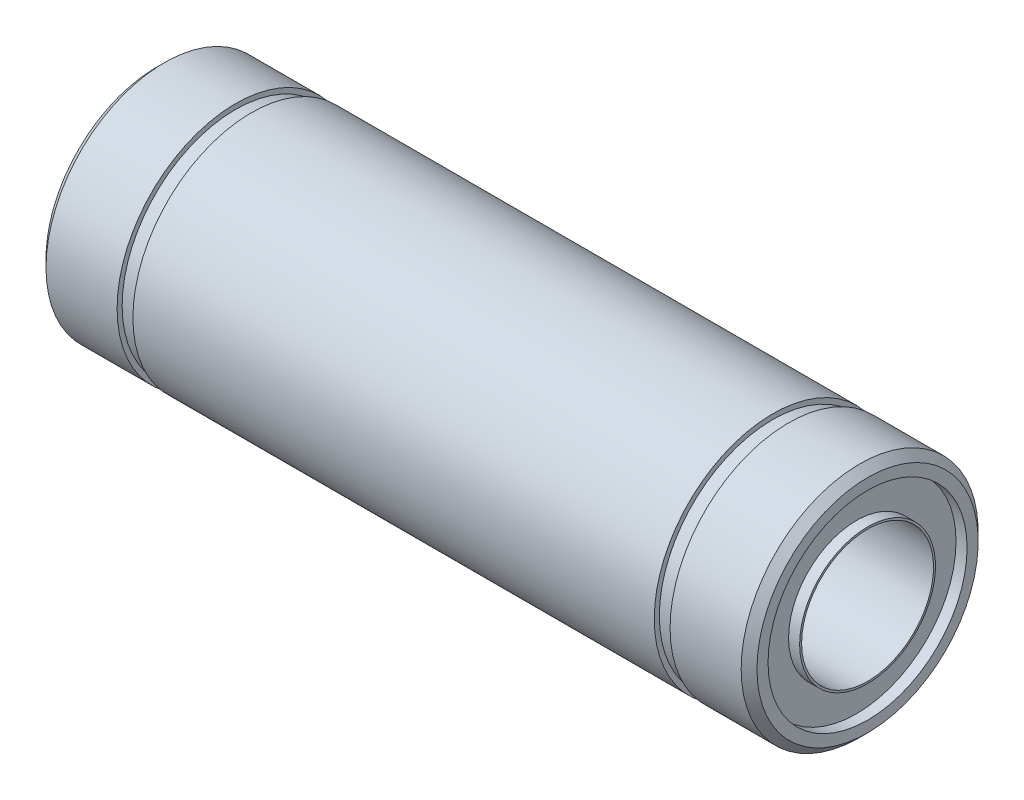
ISO-10303-21;
HEADER;
FILE_DESCRIPTION(('STEP AP214'),'2;1');
FILE_NAME('part.step','',(''),(''),'','','');
FILE_SCHEMA(('AUTOMOTIVE_DESIGN { 1 0 10303 214 1 1 1 1 }'));
ENDSEC;
DATA;
#1=APPLICATION_CONTEXT('core data for automotive mechanical design processes');
#2=APPLICATION_PROTOCOL_DEFINITION('international standard','automotive_design',2000,#1);
#3=PRODUCT_CONTEXT('',#1,'mechanical');
#4=PRODUCT('Part','Part','',(#3));
#5=PRODUCT_RELATED_PRODUCT_CATEGORY('part','',(#4));
#6=PRODUCT_DEFINITION_FORMATION('','',#4);
#7=PRODUCT_DEFINITION_CONTEXT('part definition',#1,'design');
#8=PRODUCT_DEFINITION('design','',#6,#7);
#9=PRODUCT_DEFINITION_SHAPE('','',#8);
#10=(LENGTH_UNIT() NAMED_UNIT(*) SI_UNIT(.MILLI.,.METRE.));
#11=(NAMED_UNIT(*) PLANE_ANGLE_UNIT() SI_UNIT($,.RADIAN.));
#12=(NAMED_UNIT(*) SI_UNIT($,.STERADIAN.) SOLID_ANGLE_UNIT());
#13=UNCERTAINTY_MEASURE_WITH_UNIT(LENGTH_MEASURE(1.E-05),#10,'distance_accuracy_value','');
#14=(GEOMETRIC_REPRESENTATION_CONTEXT(3) GLOBAL_UNCERTAINTY_ASSIGNED_CONTEXT((#13)) GLOBAL_UNIT_ASSIGNED_CONTEXT((#10,
#11,#12)) REPRESENTATION_CONTEXT('',''));
#15=CARTESIAN_POINT('',(0.,0.,0.));
#16=DIRECTION('',(0.,0.,1.));
#17=DIRECTION('',(1.,0.,0.));
#18=AXIS2_PLACEMENT_3D('',#15,#16,#17);
#19=CARTESIAN_POINT('',(0.,7.5,0.));
#20=DIRECTION('',(1.,0.,0.));
#21=DIRECTION('',(0.,0.,-1.));
#22=AXIS2_PLACEMENT_3D('',#19,#20,#21);
#23=PLANE('',#22);
#24=CARTESIAN_POINT('',(0.,0.,0.));
#25=DIRECTION('',(1.,0.,0.));
#26=DIRECTION('',(0.,0.,-1.));
#27=AXIS2_PLACEMENT_3D('',#24,#25,#26);
#28=CIRCLE('',#27,7.);
#29=CARTESIAN_POINT('',(0.,0.,-7.));
#30=VERTEX_POINT('',#29);
#31=EDGE_CURVE('E39',#30,#30,#28,.F.);
#32=ORIENTED_EDGE('',*,*,#31,.T.);
#33=EDGE_LOOP('',(#32));
#34=FACE_BOUND('',#33,.T.);
#35=CARTESIAN_POINT('',(0.,0.,0.));
#36=DIRECTION('',(-1.,0.,0.));
#37=DIRECTION('',(0.,0.,1.));
#38=AXIS2_PLACEMENT_3D('',#35,#36,#37);
#39=CIRCLE('',#38,6.3);
#40=CARTESIAN_POINT('',(0.,0.,6.3));
#41=VERTEX_POINT('',#40);
#42=EDGE_CURVE('E52',#41,#41,#39,.T.);
#43=ORIENTED_EDGE('',*,*,#42,.F.);
#44=EDGE_LOOP('',(#43));
#45=FACE_BOUND('',#44,.T.);
#46=ADVANCED_FACE('F32',(#34,#45),#23,.F.);
#47=CARTESIAN_POINT('',(0.,0.,0.));
#48=DIRECTION('',(-1.,0.,0.));
#49=DIRECTION('',(0.,0.,1.));
#50=AXIS2_PLACEMENT_3D('',#47,#48,#49);
#51=CYLINDRICAL_SURFACE('',#50,6.3);
#52=CARTESIAN_POINT('',(0.7,0.,0.));
#53=DIRECTION('',(-1.,0.,0.));
#54=DIRECTION('',(0.,0.,1.));
#55=AXIS2_PLACEMENT_3D('',#52,#53,#54);
#56=CIRCLE('',#55,6.3);
#57=CARTESIAN_POINT('',(0.7,0.,6.3));
#58=VERTEX_POINT('',#57);
#59=EDGE_CURVE('E55',#58,#58,#56,.T.);
#60=ORIENTED_EDGE('',*,*,#59,.F.);
#61=EDGE_LOOP('',(#60));
#62=FACE_BOUND('',#61,.T.);
#63=ORIENTED_EDGE('',*,*,#42,.T.);
#64=EDGE_LOOP('',(#63));
#65=FACE_BOUND('',#64,.T.);
#66=ADVANCED_FACE('F163',(#62,#65),#51,.F.);
#67=CARTESIAN_POINT('',(0.7,6.3,0.));
#68=DIRECTION('',(1.,0.,0.));
#69=DIRECTION('',(0.,0.,-1.));
#70=AXIS2_PLACEMENT_3D('',#67,#68,#69);
#71=PLANE('',#70);
#72=CARTESIAN_POINT('',(0.7,0.,0.));
#73=DIRECTION('',(-1.,0.,0.));
#74=DIRECTION('',(0.,0.,1.));
#75=AXIS2_PLACEMENT_3D('',#72,#73,#74);
#76=CIRCLE('',#75,4.3);
#77=CARTESIAN_POINT('',(0.7,0.,4.3));
#78=VERTEX_POINT('',#77);
#79=EDGE_CURVE('E58',#78,#78,#76,.T.);
#80=ORIENTED_EDGE('',*,*,#79,.F.);
#81=EDGE_LOOP('',(#80));
#82=FACE_BOUND('',#81,.T.);
#83=ORIENTED_EDGE('',*,*,#59,.T.);
#84=EDGE_LOOP('',(#83));
#85=FACE_BOUND('',#84,.T.);
#86=ADVANCED_FACE('F168',(#82,#85),#71,.F.);
#87=CARTESIAN_POINT('',(0.,0.,0.));
#88=DIRECTION('',(-1.,0.,0.));
#89=DIRECTION('',(0.,0.,1.));
#90=AXIS2_PLACEMENT_3D('',#87,#88,#89);
#91=CYLINDRICAL_SURFACE('',#90,4.3);
#92=CARTESIAN_POINT('',(0.,0.,0.));
#93=DIRECTION('',(-1.,0.,0.));
#94=DIRECTION('',(0.,0.,1.));
#95=AXIS2_PLACEMENT_3D('',#92,#93,#94);
#96=CIRCLE('',#95,4.3);
#97=CARTESIAN_POINT('',(0.,0.,4.3));
#98=VERTEX_POINT('',#97);
#99=EDGE_CURVE('E61',#98,#98,#96,.T.);
#100=ORIENTED_EDGE('',*,*,#99,.F.);
#101=EDGE_LOOP('',(#100));
#102=FACE_BOUND('',#101,.T.);
#103=ORIENTED_EDGE('',*,*,#79,.T.);
#104=EDGE_LOOP('',(#103));
#105=FACE_BOUND('',#104,.T.);
#106=ADVANCED_FACE('F220',(#102,#105),#91,.T.);
#107=CARTESIAN_POINT('',(0.,4.3,0.));
#108=DIRECTION('',(1.,0.,0.));
#109=DIRECTION('',(0.,0.,-1.));
#110=AXIS2_PLACEMENT_3D('',#107,#108,#109);
#111=PLANE('',#110);
#112=CARTESIAN_POINT('',(0.,0.,0.));
#113=DIRECTION('',(-1.,0.,0.));
#114=DIRECTION('',(0.,0.,1.));
#115=AXIS2_PLACEMENT_3D('',#112,#113,#114);
#116=CIRCLE('',#115,4.175);
#117=CARTESIAN_POINT('',(0.,0.,4.175));
#118=VERTEX_POINT('',#117);
#119=EDGE_CURVE('E64',#118,#118,#116,.T.);
#120=ORIENTED_EDGE('',*,*,#119,.F.);
#121=EDGE_LOOP('',(#120));
#122=FACE_BOUND('',#121,.T.);
#123=ORIENTED_EDGE('',*,*,#99,.T.);
#124=EDGE_LOOP('',(#123));
#125=FACE_BOUND('',#124,.T.);
#126=ADVANCED_FACE('F214',(#122,#125),#111,.F.);
#127=CARTESIAN_POINT('',(0.,0.,0.));
#128=DIRECTION('',(-1.,0.,0.));
#129=DIRECTION('',(0.,0.,1.));
#130=AXIS2_PLACEMENT_3D('',#127,#128,#129);
#131=CYLINDRICAL_SURFACE('',#130,4.175);
#132=CARTESIAN_POINT('',(45.,0.,0.));
#133=DIRECTION('',(-1.,0.,0.));
#134=DIRECTION('',(0.,0.,1.));
#135=AXIS2_PLACEMENT_3D('',#132,#133,#134);
#136=CIRCLE('',#135,4.175);
#137=CARTESIAN_POINT('',(45.,0.,4.175));
#138=VERTEX_POINT('',#137);
#139=EDGE_CURVE('E67',#138,#138,#136,.T.);
#140=ORIENTED_EDGE('',*,*,#139,.F.);
#141=EDGE_LOOP('',(#140));
#142=FACE_BOUND('',#141,.T.);
#143=ORIENTED_EDGE('',*,*,#119,.T.);
#144=EDGE_LOOP('',(#143));
#145=FACE_BOUND('',#144,.T.);
#146=ADVANCED_FACE('F208',(#142,#145),#131,.F.);
#147=CARTESIAN_POINT('',(45.,4.3,0.));
#148=DIRECTION('',(-1.,0.,0.));
#149=DIRECTION('',(0.,0.,1.));
#150=AXIS2_PLACEMENT_3D('',#147,#148,#149);
#151=PLANE('',#150);
#152=CARTESIAN_POINT('',(45.,0.,0.));
#153=DIRECTION('',(-1.,0.,0.));
#154=DIRECTION('',(0.,0.,1.));
#155=AXIS2_PLACEMENT_3D('',#152,#153,#154);
#156=CIRCLE('',#155,4.3);
#157=CARTESIAN_POINT('',(45.,0.,4.3));
#158=VERTEX_POINT('',#157);
#159=EDGE_CURVE('E70',#158,#158,#156,.T.);
#160=ORIENTED_EDGE('',*,*,#159,.F.);
#161=EDGE_LOOP('',(#160));
#162=FACE_BOUND('',#161,.T.);
#163=ORIENTED_EDGE('',*,*,#139,.T.);
#164=EDGE_LOOP('',(#163));
#165=FACE_BOUND('',#164,.T.);
#166=ADVANCED_FACE('F202',(#162,#165),#151,.F.);
#167=CARTESIAN_POINT('',(0.,0.,0.));
#168=DIRECTION('',(-1.,0.,0.));
#169=DIRECTION('',(0.,0.,1.));
#170=AXIS2_PLACEMENT_3D('',#167,#168,#169);
#171=CYLINDRICAL_SURFACE('',#170,4.3);
#172=CARTESIAN_POINT('',(44.3,0.,0.));
#173=DIRECTION('',(-1.,0.,0.));
#174=DIRECTION('',(0.,0.,1.));
#175=AXIS2_PLACEMENT_3D('',#172,#173,#174);
#176=CIRCLE('',#175,4.3);
#177=CARTESIAN_POINT('',(44.3,0.,4.3));
#178=VERTEX_POINT('',#177);
#179=EDGE_CURVE('E73',#178,#178,#176,.T.);
#180=ORIENTED_EDGE('',*,*,#179,.F.);
#181=EDGE_LOOP('',(#180));
#182=FACE_BOUND('',#181,.T.);
#183=ORIENTED_EDGE('',*,*,#159,.T.);
#184=EDGE_LOOP('',(#183));
#185=FACE_BOUND('',#184,.T.);
#186=ADVANCED_FACE('F196',(#182,#185),#171,.T.);
#187=CARTESIAN_POINT('',(44.3,6.3,0.));
#188=DIRECTION('',(-1.,0.,0.));
#189=DIRECTION('',(0.,0.,1.));
#190=AXIS2_PLACEMENT_3D('',#187,#188,#189);
#191=PLANE('',#190);
#192=CARTESIAN_POINT('',(44.3,0.,0.));
#193=DIRECTION('',(-1.,0.,0.));
#194=DIRECTION('',(0.,0.,1.));
#195=AXIS2_PLACEMENT_3D('',#192,#193,#194);
#196=CIRCLE('',#195,6.3);
#197=CARTESIAN_POINT('',(44.3,0.,6.3));
#198=VERTEX_POINT('',#197);
#199=EDGE_CURVE('E76',#198,#198,#196,.T.);
#200=ORIENTED_EDGE('',*,*,#199,.F.);
#201=EDGE_LOOP('',(#200));
#202=FACE_BOUND('',#201,.T.);
#203=ORIENTED_EDGE('',*,*,#179,.T.);
#204=EDGE_LOOP('',(#203));
#205=FACE_BOUND('',#204,.T.);
#206=ADVANCED_FACE('F190',(#202,#205),#191,.F.);
#207=CARTESIAN_POINT('',(0.,0.,0.));
#208=DIRECTION('',(-1.,0.,0.));
#209=DIRECTION('',(0.,0.,1.));
#210=AXIS2_PLACEMENT_3D('',#207,#208,#209);
#211=CYLINDRICAL_SURFACE('',#210,6.3);
#212=CARTESIAN_POINT('',(45.,0.,0.));
#213=DIRECTION('',(-1.,0.,0.));
#214=DIRECTION('',(0.,0.,1.));
#215=AXIS2_PLACEMENT_3D('',#212,#213,#214);
#216=CIRCLE('',#215,6.3);
#217=CARTESIAN_POINT('',(45.,0.,6.3));
#218=VERTEX_POINT('',#217);
#219=EDGE_CURVE('E79',#218,#218,#216,.T.);
#220=ORIENTED_EDGE('',*,*,#219,.F.);
#221=EDGE_LOOP('',(#220));
#222=FACE_BOUND('',#221,.T.);
#223=ORIENTED_EDGE('',*,*,#199,.T.);
#224=EDGE_LOOP('',(#223));
#225=FACE_BOUND('',#224,.T.);
#226=ADVANCED_FACE('F159',(#222,#225),#211,.F.);
#227=CARTESIAN_POINT('',(45.,7.5,0.));
#228=DIRECTION('',(-1.,0.,0.));
#229=DIRECTION('',(0.,0.,1.));
#230=AXIS2_PLACEMENT_3D('',#227,#228,#229);
#231=PLANE('',#230);
#232=CARTESIAN_POINT('',(45.,0.,0.));
#233=DIRECTION('',(-1.,0.,0.));
#234=DIRECTION('',(0.,0.,1.));
#235=AXIS2_PLACEMENT_3D('',#232,#233,#234);
#236=CIRCLE('',#235,7.00000000000001);
#237=CARTESIAN_POINT('',(45.,0.,7.00000000000001));
#238=VERTEX_POINT('',#237);
#239=EDGE_CURVE('E43',#238,#238,#236,.F.);
#240=ORIENTED_EDGE('',*,*,#239,.T.);
#241=EDGE_LOOP('',(#240));
#242=FACE_BOUND('',#241,.T.);
#243=ORIENTED_EDGE('',*,*,#219,.T.);
#244=EDGE_LOOP('',(#243));
#245=FACE_BOUND('',#244,.T.);
#246=ADVANCED_FACE('F153',(#242,#245),#231,.F.);
#247=CARTESIAN_POINT('',(0.,0.,0.));
#248=DIRECTION('',(-1.,0.,0.));
#249=DIRECTION('',(0.,0.,1.));
#250=AXIS2_PLACEMENT_3D('',#247,#248,#249);
#251=CYLINDRICAL_SURFACE('',#250,7.5);
#252=CARTESIAN_POINT('',(44.5,0.,0.));
#253=DIRECTION('',(-1.,0.,0.));
#254=DIRECTION('',(0.,0.,1.));
#255=AXIS2_PLACEMENT_3D('',#252,#253,#254);
#256=CIRCLE('',#255,7.5);
#257=CARTESIAN_POINT('',(44.5,0.,7.5));
#258=VERTEX_POINT('',#257);
#259=EDGE_CURVE('E47',#258,#258,#256,.T.);
#260=ORIENTED_EDGE('',*,*,#259,.T.);
#261=EDGE_LOOP('',(#260));
#262=FACE_BOUND('',#261,.T.);
#263=CARTESIAN_POINT('',(40.,0.,0.));
#264=DIRECTION('',(-1.,0.,0.));
#265=DIRECTION('',(0.,0.,1.));
#266=AXIS2_PLACEMENT_3D('',#263,#264,#265);
#267=CIRCLE('',#266,7.5);
#268=CARTESIAN_POINT('',(40.,0.,7.5));
#269=VERTEX_POINT('',#268);
#270=EDGE_CURVE('E82',#269,#269,#267,.T.);
#271=ORIENTED_EDGE('',*,*,#270,.F.);
#272=EDGE_LOOP('',(#271));
#273=FACE_BOUND('',#272,.T.);
#274=ADVANCED_FACE('F148',(#262,#273),#251,.T.);
#275=CARTESIAN_POINT('',(40.,7.5,0.));
#276=DIRECTION('',(1.,0.,0.));
#277=DIRECTION('',(0.,0.,-1.));
#278=AXIS2_PLACEMENT_3D('',#275,#276,#277);
#279=PLANE('',#278);
#280=CARTESIAN_POINT('',(40.,0.,0.));
#281=DIRECTION('',(-1.,0.,0.));
#282=DIRECTION('',(0.,0.,1.));
#283=AXIS2_PLACEMENT_3D('',#280,#281,#282);
#284=CIRCLE('',#283,7.18);
#285=CARTESIAN_POINT('',(40.,0.,7.18));
#286=VERTEX_POINT('',#285);
#287=EDGE_CURVE('E85',#286,#286,#284,.T.);
#288=ORIENTED_EDGE('',*,*,#287,.F.);
#289=EDGE_LOOP('',(#288));
#290=FACE_BOUND('',#289,.T.);
#291=ORIENTED_EDGE('',*,*,#270,.T.);
#292=EDGE_LOOP('',(#291));
#293=FACE_BOUND('',#292,.T.);
#294=ADVANCED_FACE('F142',(#290,#293),#279,.F.);
#295=CARTESIAN_POINT('',(0.,0.,0.));
#296=DIRECTION('',(-1.,0.,0.));
#297=DIRECTION('',(0.,0.,1.));
#298=AXIS2_PLACEMENT_3D('',#295,#296,#297);
#299=CYLINDRICAL_SURFACE('',#298,7.18);
#300=CARTESIAN_POINT('',(39.,0.,0.));
#301=DIRECTION('',(-1.,0.,0.));
#302=DIRECTION('',(0.,0.,1.));
#303=AXIS2_PLACEMENT_3D('',#300,#301,#302);
#304=CIRCLE('',#303,7.18);
#305=CARTESIAN_POINT('',(39.,0.,7.18));
#306=VERTEX_POINT('',#305);
#307=EDGE_CURVE('E88',#306,#306,#304,.T.);
#308=ORIENTED_EDGE('',*,*,#307,.F.);
#309=EDGE_LOOP('',(#308));
#310=FACE_BOUND('',#309,.T.);
#311=ORIENTED_EDGE('',*,*,#287,.T.);
#312=EDGE_LOOP('',(#311));
#313=FACE_BOUND('',#312,.T.);
#314=ADVANCED_FACE('F136',(#310,#313),#299,.T.);
#315=CARTESIAN_POINT('',(39.,7.5,0.));
#316=DIRECTION('',(-1.,0.,0.));
#317=DIRECTION('',(0.,0.,1.));
#318=AXIS2_PLACEMENT_3D('',#315,#316,#317);
#319=PLANE('',#318);
#320=CARTESIAN_POINT('',(39.,0.,0.));
#321=DIRECTION('',(-1.,0.,0.));
#322=DIRECTION('',(0.,0.,1.));
#323=AXIS2_PLACEMENT_3D('',#320,#321,#322);
#324=CIRCLE('',#323,7.5);
#325=CARTESIAN_POINT('',(39.,0.,7.5));
#326=VERTEX_POINT('',#325);
#327=EDGE_CURVE('E91',#326,#326,#324,.T.);
#328=ORIENTED_EDGE('',*,*,#327,.F.);
#329=EDGE_LOOP('',(#328));
#330=FACE_BOUND('',#329,.T.);
#331=ORIENTED_EDGE('',*,*,#307,.T.);
#332=EDGE_LOOP('',(#331));
#333=FACE_BOUND('',#332,.T.);
#334=ADVANCED_FACE('F130',(#330,#333),#319,.F.);
#335=CARTESIAN_POINT('',(0.,0.,0.));
#336=DIRECTION('',(-1.,0.,0.));
#337=DIRECTION('',(0.,0.,1.));
#338=AXIS2_PLACEMENT_3D('',#335,#336,#337);
#339=CYLINDRICAL_SURFACE('',#338,7.5);
#340=CARTESIAN_POINT('',(6.,0.,0.));
#341=DIRECTION('',(-1.,0.,0.));
#342=DIRECTION('',(0.,0.,1.));
#343=AXIS2_PLACEMENT_3D('',#340,#341,#342);
#344=CIRCLE('',#343,7.5);
#345=CARTESIAN_POINT('',(6.,0.,7.5));
#346=VERTEX_POINT('',#345);
#347=EDGE_CURVE('E94',#346,#346,#344,.T.);
#348=ORIENTED_EDGE('',*,*,#347,.F.);
#349=EDGE_LOOP('',(#348));
#350=FACE_BOUND('',#349,.T.);
#351=ORIENTED_EDGE('',*,*,#327,.T.);
#352=EDGE_LOOP('',(#351));
#353=FACE_BOUND('',#352,.T.);
#354=ADVANCED_FACE('F124',(#350,#353),#339,.T.);
#355=CARTESIAN_POINT('',(6.,7.5,0.));
#356=DIRECTION('',(1.,0.,0.));
#357=DIRECTION('',(0.,0.,-1.));
#358=AXIS2_PLACEMENT_3D('',#355,#356,#357);
#359=PLANE('',#358);
#360=CARTESIAN_POINT('',(6.,0.,0.));
#361=DIRECTION('',(-1.,0.,0.));
#362=DIRECTION('',(0.,0.,1.));
#363=AXIS2_PLACEMENT_3D('',#360,#361,#362);
#364=CIRCLE('',#363,7.18);
#365=CARTESIAN_POINT('',(6.,0.,7.18));
#366=VERTEX_POINT('',#365);
#367=EDGE_CURVE('E97',#366,#366,#364,.T.);
#368=ORIENTED_EDGE('',*,*,#367,.F.);
#369=EDGE_LOOP('',(#368));
#370=FACE_BOUND('',#369,.T.);
#371=ORIENTED_EDGE('',*,*,#347,.T.);
#372=EDGE_LOOP('',(#371));
#373=FACE_BOUND('',#372,.T.);
#374=ADVANCED_FACE('F118',(#370,#373),#359,.F.);
#375=CARTESIAN_POINT('',(0.,0.,0.));
#376=DIRECTION('',(-1.,0.,0.));
#377=DIRECTION('',(0.,0.,1.));
#378=AXIS2_PLACEMENT_3D('',#375,#376,#377);
#379=CYLINDRICAL_SURFACE('',#378,7.18);
#380=CARTESIAN_POINT('',(5.,0.,0.));
#381=DIRECTION('',(-1.,0.,0.));
#382=DIRECTION('',(0.,0.,1.));
#383=AXIS2_PLACEMENT_3D('',#380,#381,#382);
#384=CIRCLE('',#383,7.18);
#385=CARTESIAN_POINT('',(5.,0.,7.18));
#386=VERTEX_POINT('',#385);
#387=EDGE_CURVE('E100',#386,#386,#384,.T.);
#388=ORIENTED_EDGE('',*,*,#387,.F.);
#389=EDGE_LOOP('',(#388));
#390=FACE_BOUND('',#389,.T.);
#391=ORIENTED_EDGE('',*,*,#367,.T.);
#392=EDGE_LOOP('',(#391));
#393=FACE_BOUND('',#392,.T.);
#394=ADVANCED_FACE('F112',(#390,#393),#379,.T.);
#395=CARTESIAN_POINT('',(5.,7.5,0.));
#396=DIRECTION('',(-1.,0.,0.));
#397=DIRECTION('',(0.,0.,1.));
#398=AXIS2_PLACEMENT_3D('',#395,#396,#397);
#399=PLANE('',#398);
#400=CARTESIAN_POINT('',(5.,0.,0.));
#401=DIRECTION('',(-1.,0.,0.));
#402=DIRECTION('',(0.,0.,1.));
#403=AXIS2_PLACEMENT_3D('',#400,#401,#402);
#404=CIRCLE('',#403,7.5);
#405=CARTESIAN_POINT('',(5.,0.,7.5));
#406=VERTEX_POINT('',#405);
#407=EDGE_CURVE('E103',#406,#406,#404,.T.);
#408=ORIENTED_EDGE('',*,*,#407,.F.);
#409=EDGE_LOOP('',(#408));
#410=FACE_BOUND('',#409,.T.);
#411=ORIENTED_EDGE('',*,*,#387,.T.);
#412=EDGE_LOOP('',(#411));
#413=FACE_BOUND('',#412,.T.);
#414=ADVANCED_FACE('F109',(#410,#413),#399,.F.);
#415=CARTESIAN_POINT('',(0.,0.,0.));
#416=DIRECTION('',(-1.,0.,0.));
#417=DIRECTION('',(0.,0.,1.));
#418=AXIS2_PLACEMENT_3D('',#415,#416,#417);
#419=CYLINDRICAL_SURFACE('',#418,7.5);
#420=CARTESIAN_POINT('',(0.500000000000006,0.,0.));
#421=DIRECTION('',(1.,0.,0.));
#422=DIRECTION('',(0.,0.,-1.));
#423=AXIS2_PLACEMENT_3D('',#420,#421,#422);
#424=CIRCLE('',#423,7.5);
#425=CARTESIAN_POINT('',(0.500000000000006,0.,-7.5));
#426=VERTEX_POINT('',#425);
#427=EDGE_CURVE('E10',#426,#426,#424,.T.);
#428=ORIENTED_EDGE('',*,*,#427,.T.);
#429=EDGE_LOOP('',(#428));
#430=FACE_BOUND('',#429,.T.);
#431=ORIENTED_EDGE('',*,*,#407,.T.);
#432=EDGE_LOOP('',(#431));
#433=FACE_BOUND('',#432,.T.);
#434=ADVANCED_FACE('F107',(#430,#433),#419,.T.);
#435=CARTESIAN_POINT('',(44.5,0.,0.));
#436=DIRECTION('',(-1.,0.,0.));
#437=DIRECTION('',(0.,0.,1.));
#438=AXIS2_PLACEMENT_3D('',#435,#436,#437);
#439=CONICAL_SURFACE('',#438,7.5,0.785398163397446);
#440=ORIENTED_EDGE('',*,*,#239,.F.);
#441=EDGE_LOOP('',(#440));
#442=FACE_BOUND('',#441,.T.);
#443=ORIENTED_EDGE('',*,*,#259,.F.);
#444=EDGE_LOOP('',(#443));
#445=FACE_BOUND('',#444,.T.);
#446=ADVANCED_FACE('F173',(#442,#445),#439,.T.);
#447=CARTESIAN_POINT('',(0.,0.,0.));
#448=DIRECTION('',(1.,0.,0.));
#449=DIRECTION('',(0.,0.,-1.));
#450=AXIS2_PLACEMENT_3D('',#447,#448,#449);
#451=CONICAL_SURFACE('',#450,7.,0.785398163397444);
#452=ORIENTED_EDGE('',*,*,#427,.F.);
#453=EDGE_LOOP('',(#452));
#454=FACE_BOUND('',#453,.T.);
#455=ORIENTED_EDGE('',*,*,#31,.F.);
#456=EDGE_LOOP('',(#455));
#457=FACE_BOUND('',#456,.T.);
#458=ADVANCED_FACE('F34',(#454,#457),#451,.T.);
#459=CLOSED_SHELL('',(#46,#66,#86,#106,#126,#146,#166,#186,#206,#226,#246,#274,#294,#314,#334,
#354,#374,#394,#414,#434,#446,#458));
#460=MANIFOLD_SOLID_BREP('B2',#459);
#461=ADVANCED_BREP_SHAPE_REPRESENTATION('',(#18,#460),#14);
#462=SHAPE_DEFINITION_REPRESENTATION(#9,#461);
ENDSEC;
END-ISO-10303-21;
